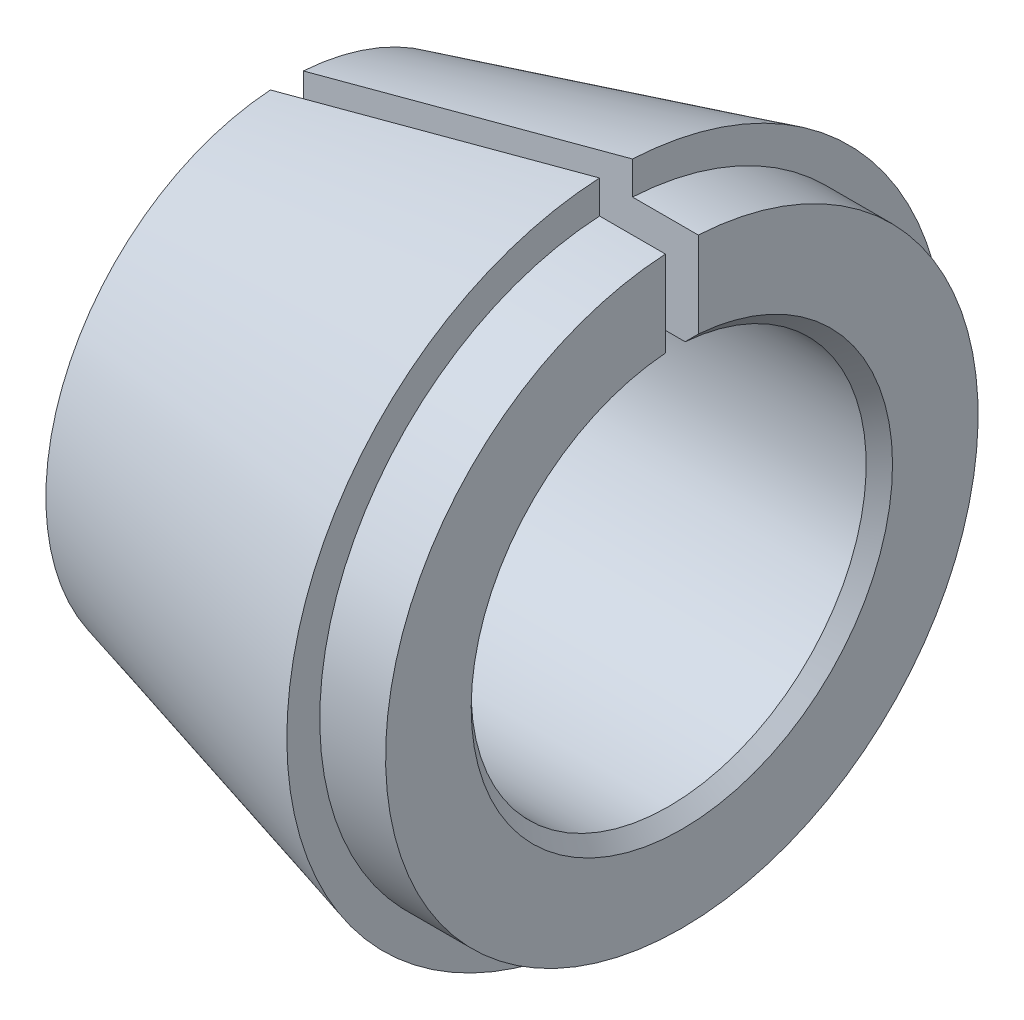
ISO-10303-21;
HEADER;
FILE_DESCRIPTION(('STEP AP214'),'2;1');
FILE_NAME('part.step','',(''),(''),'','','');
FILE_SCHEMA(('AUTOMOTIVE_DESIGN { 1 0 10303 214 1 1 1 1 }'));
ENDSEC;
DATA;
#1=APPLICATION_CONTEXT('core data for automotive mechanical design processes');
#2=APPLICATION_PROTOCOL_DEFINITION('international standard','automotive_design',2000,#1);
#3=PRODUCT_CONTEXT('',#1,'mechanical');
#4=PRODUCT('Part','Part','',(#3));
#5=PRODUCT_RELATED_PRODUCT_CATEGORY('part','',(#4));
#6=PRODUCT_DEFINITION_FORMATION('','',#4);
#7=PRODUCT_DEFINITION_CONTEXT('part definition',#1,'design');
#8=PRODUCT_DEFINITION('design','',#6,#7);
#9=PRODUCT_DEFINITION_SHAPE('','',#8);
#10=(LENGTH_UNIT() NAMED_UNIT(*) SI_UNIT(.MILLI.,.METRE.));
#11=(NAMED_UNIT(*) PLANE_ANGLE_UNIT() SI_UNIT($,.RADIAN.));
#12=(NAMED_UNIT(*) SI_UNIT($,.STERADIAN.) SOLID_ANGLE_UNIT());
#13=UNCERTAINTY_MEASURE_WITH_UNIT(LENGTH_MEASURE(1.E-05),#10,'distance_accuracy_value','');
#14=(GEOMETRIC_REPRESENTATION_CONTEXT(3) GLOBAL_UNCERTAINTY_ASSIGNED_CONTEXT((#13)) GLOBAL_UNIT_ASSIGNED_CONTEXT((#10,
#11,#12)) REPRESENTATION_CONTEXT('',''));
#15=CARTESIAN_POINT('',(0.,0.,0.));
#16=DIRECTION('',(0.,0.,1.));
#17=DIRECTION('',(1.,0.,0.));
#18=AXIS2_PLACEMENT_3D('',#15,#16,#17);
#19=CARTESIAN_POINT('',(-0.200000000000002,0.,0.));
#20=DIRECTION('',(1.,0.,0.));
#21=DIRECTION('',(0.,1.,0.));
#22=AXIS2_PLACEMENT_3D('',#19,#20,#21);
#23=CONICAL_SURFACE('',#22,3.,0.785398163397443);
#24=CARTESIAN_POINT('',(-0.200000000000002,0.,0.));
#25=DIRECTION('',(1.,0.,0.));
#26=DIRECTION('',(0.,1.,0.));
#27=AXIS2_PLACEMENT_3D('',#24,#25,#26);
#28=CIRCLE('',#27,3.);
#29=CARTESIAN_POINT('',(-0.200000000000002,2.98956518577535,0.25));
#30=VERTEX_POINT('',#29);
#31=CARTESIAN_POINT('',(-0.200000000000002,2.98956518577535,-0.25));
#32=VERTEX_POINT('',#31);
#33=EDGE_CURVE('E129',#30,#32,#28,.T.);
#34=ORIENTED_EDGE('',*,*,#33,.F.);
#35=CARTESIAN_POINT('',(-2.66711376518774,0.470603590352237,0.25));
#36=CARTESIAN_POINT('',(-2.6498790626406,0.490111763503367,0.25));
#37=CARTESIAN_POINT('',(-2.63252033393419,0.509509212474907,0.25));
#38=CARTESIAN_POINT('',(-2.59760937001322,0.548128017215426,0.25));
#39=CARTESIAN_POINT('',(-2.58005714213341,0.567349379608882,0.25));
#40=CARTESIAN_POINT('',(-2.52719359119103,0.624815712816943,0.25));
#41=CARTESIAN_POINT('',(-2.49167191801495,0.662866828880821,0.25));
#42=CARTESIAN_POINT('',(-2.42029667113215,0.738645739791032,0.25));
#43=CARTESIAN_POINT('',(-2.38444314177607,0.776373576580086,0.25));
#44=CARTESIAN_POINT('',(-2.31251318324246,0.851618364142729,0.25));
#45=CARTESIAN_POINT('',(-2.276436746691,0.889135307860569,0.25));
#46=CARTESIAN_POINT('',(-2.16801433047007,1.00143924613179,0.25));
#47=CARTESIAN_POINT('',(-2.09544539579988,1.07601076079007,0.25));
#48=CARTESIAN_POINT('',(-1.94999472058601,1.22484826261092,0.25));
#49=CARTESIAN_POINT('',(-1.87711297791828,1.29911424769215,0.25));
#50=CARTESIAN_POINT('',(-1.65819348190414,1.52164176661177,0.25));
#51=CARTESIAN_POINT('',(-1.51188121716294,1.66963311397587,0.25));
#52=CARTESIAN_POINT('',(-1.21892955487606,1.96532900190161,0.25));
#53=CARTESIAN_POINT('',(-1.07229011733684,2.11303350274599,0.25));
#54=CARTESIAN_POINT('',(-0.778841153523599,2.40827236116131,0.25));
#55=CARTESIAN_POINT('',(-0.632031627919382,2.55580671939774,0.25));
#56=CARTESIAN_POINT('',(-0.445148642724675,2.74348667298526,0.25));
#57=CARTESIAN_POINT('',(-0.405120873718359,2.78367780636682,0.25));
#58=CARTESIAN_POINT('',(-0.325059607630241,2.86405212469672,0.25));
#59=CARTESIAN_POINT('',(-0.285026110740466,2.9042353098363,0.25));
#60=CARTESIAN_POINT('',(0.162242787687722,3.35311658759649,0.25));
#61=CARTESIAN_POINT('',(0.569753263663969,3.76154055353879,0.25));
#62=CARTESIAN_POINT('',(1.18119474734201,4.3740698907972,0.25));
#63=CARTESIAN_POINT('',(1.38505512541592,4.57824583791917,0.25));
#64=CARTESIAN_POINT('',(1.79281205170518,4.98656151312424,0.25));
#65=CARTESIAN_POINT('',(1.99670859991173,5.19070124121613,0.25));
#66=CARTESIAN_POINT('',(2.200617813936,5.39482833574921,0.25));
#67=B_SPLINE_CURVE_WITH_KNOTS('',3,(#35,#36,#37,#38,#39,#40,#41,#42,#43,#44,#45,#46,#47,#48,#49,
#50,#51,#52,#53,#54,#55,#56,#57,#58,#59,#60,#61,#62,#63,#64,#65,#66),.UNSPECIFIED.,.F.,.F.,(4,2,
2,2,2,2,2,2,2,2,2,2,2,2,2,4),(0.,0.0780906859410044,0.156178421901177,0.312338211237489,
0.468477423707746,0.624621829326727,0.936780647884491,1.24894158944398,1.87326242618071,
2.4976642928112,3.12206370884976,3.29223405336983,3.46239962757663,5.19325872634942,
6.05883475381138,6.92441057103953),.UNSPECIFIED.);
#68=CARTESIAN_POINT('',(0.,3.19021942818985,0.25));
#69=VERTEX_POINT('',#68);
#70=EDGE_CURVE('E143',#30,#69,#67,.T.);
#71=ORIENTED_EDGE('',*,*,#70,.T.);
#72=CARTESIAN_POINT('',(0.,0.,0.));
#73=DIRECTION('',(1.,0.,0.));
#74=DIRECTION('',(0.,1.,0.));
#75=AXIS2_PLACEMENT_3D('',#72,#73,#74);
#76=CIRCLE('',#75,3.2);
#77=CARTESIAN_POINT('',(0.,3.19021942818985,-0.25));
#78=VERTEX_POINT('',#77);
#79=EDGE_CURVE('E136',#69,#78,#76,.T.);
#80=ORIENTED_EDGE('',*,*,#79,.T.);
#81=CARTESIAN_POINT('',(2.200617813936,5.39482833574921,-0.25));
#82=CARTESIAN_POINT('',(1.99672436377642,5.19071348795527,-0.25));
#83=CARTESIAN_POINT('',(1.79284091477196,4.98658864327339,-0.25));
#84=CARTESIAN_POINT('',(1.38511193765186,4.57830450006277,-0.25));
#85=CARTESIAN_POINT('',(1.18126640923297,4.37414520183689,-0.25));
#86=CARTESIAN_POINT('',(0.773632493464094,3.96577899891927,-0.25));
#87=CARTESIAN_POINT('',(0.569844104900843,3.76157209543868,-0.25));
#88=CARTESIAN_POINT('',(0.162349112625562,3.35307336957522,-0.25));
#89=CARTESIAN_POINT('',(-0.0413574904075303,3.14878154651493,-0.25));
#90=CARTESIAN_POINT('',(-0.346811001846159,2.84222808536969,-0.25));
#91=CARTESIAN_POINT('',(-0.448613531666726,2.74002187343519,-0.25));
#92=CARTESIAN_POINT('',(-0.652165872680217,2.53555761335125,-0.25));
#93=CARTESIAN_POINT('',(-0.753915684040837,2.43329956536878,-0.25));
#94=CARTESIAN_POINT('',(-0.957337653979458,2.22871129632099,-0.25));
#95=CARTESIAN_POINT('',(-1.05900981442538,2.12638107711347,-0.25));
#96=CARTESIAN_POINT('',(-1.26224071493553,1.92160573666105,-0.25));
#97=CARTESIAN_POINT('',(-1.36379945368776,1.81916061411393,-0.25));
#98=CARTESIAN_POINT('',(-1.5667422581918,1.61407995623535,-0.25));
#99=CARTESIAN_POINT('',(-1.66812630826193,1.51144440536825,-0.25));
#100=CARTESIAN_POINT('',(-1.81994976179631,1.35724622339316,-0.25));
#101=CARTESIAN_POINT('',(-1.8705144934332,1.30580702461644,-0.25));
#102=CARTESIAN_POINT('',(-1.97152492029961,1.20281059490399,-0.25));
#103=CARTESIAN_POINT('',(-2.02197061410325,1.15125336256882,-0.25));
#104=CARTESIAN_POINT('',(-2.12269307891911,1.04796055553384,-0.25));
#105=CARTESIAN_POINT('',(-2.17296982630304,0.996224957783616,-0.25));
#106=CARTESIAN_POINT('',(-2.27325061186618,0.892492749440925,-0.25));
#107=CARTESIAN_POINT('',(-2.32325465901946,0.840496147547108,-0.25));
#108=CARTESIAN_POINT('',(-2.3979177282966,0.762166178242518,-0.25));
#109=CARTESIAN_POINT('',(-2.4227501860155,0.735998277808991,-0.25));
#110=CARTESIAN_POINT('',(-2.47225485173967,0.683512143596488,-0.25));
#111=CARTESIAN_POINT('',(-2.49692706258947,0.657193912501678,-0.25));
#112=CARTESIAN_POINT('',(-2.54605613245007,0.604350620802389,-0.25));
#113=CARTESIAN_POINT('',(-2.57051296578879,0.577825536233749,-0.25));
#114=CARTESIAN_POINT('',(-2.61909310931655,0.52446909485813,-0.25));
#115=CARTESIAN_POINT('',(-2.64321639862149,0.497637719063725,-0.25));
#116=CARTESIAN_POINT('',(-2.66711376518774,0.470603590352237,-0.25));
#117=B_SPLINE_CURVE_WITH_KNOTS('',3,(#81,#82,#83,#84,#85,#86,#87,#88,#89,#90,#91,#92,#93,#94,
#95,#96,#97,#98,#99,#100,#101,#102,#103,#104,#105,#106,#107,#108,#109,#110,#111,#112,#113,#114,
#115,#116),.UNSPECIFIED.,.F.,.F.,(4,2,2,2,2,2,2,2,2,2,2,2,2,2,2,2,2,4),(0.,0.865516437340361,
1.73102562645916,2.59651478448795,3.46201098461514,3.89477971239988,4.32754705499977,
4.76030363688743,5.19306517388364,5.62586372262488,5.84225456595348,6.05864798829029,
6.27507051033134,6.49148586678579,6.59971052873333,6.70793326432321,6.81616872959577,
6.92441094137355),.UNSPECIFIED.);
#118=EDGE_CURVE('E46',#78,#32,#117,.T.);
#119=ORIENTED_EDGE('',*,*,#118,.T.);
#120=EDGE_LOOP('',(#34,#71,#80,#119));
#121=FACE_BOUND('',#120,.T.);
#122=ADVANCED_FACE('F31',(#121),#23,.F.);
#123=CARTESIAN_POINT('',(0.,0.,0.));
#124=DIRECTION('',(1.,0.,0.));
#125=DIRECTION('',(0.,1.,0.));
#126=AXIS2_PLACEMENT_3D('',#123,#124,#125);
#127=CYLINDRICAL_SURFACE('',#126,3.);
#128=CARTESIAN_POINT('',(-5.8,0.,0.));
#129=DIRECTION('',(1.,0.,0.));
#130=DIRECTION('',(0.,1.,0.));
#131=AXIS2_PLACEMENT_3D('',#128,#129,#130);
#132=CIRCLE('',#131,3.);
#133=CARTESIAN_POINT('',(-5.8,2.98956518577535,0.25));
#134=VERTEX_POINT('',#133);
#135=CARTESIAN_POINT('',(-5.8,2.98956518577535,-0.25));
#136=VERTEX_POINT('',#135);
#137=EDGE_CURVE('E121',#134,#136,#132,.T.);
#138=ORIENTED_EDGE('',*,*,#137,.F.);
#139=DIRECTION('',(1.,0.,0.));
#140=VECTOR('',#139,1.);
#141=CARTESIAN_POINT('',(0.,2.98956518577535,0.25));
#142=LINE('',#141,#140);
#143=EDGE_CURVE('E146',#134,#30,#142,.T.);
#144=ORIENTED_EDGE('',*,*,#143,.T.);
#145=ORIENTED_EDGE('',*,*,#33,.T.);
#146=DIRECTION('',(1.,0.,0.));
#147=VECTOR('',#146,1.);
#148=CARTESIAN_POINT('',(0.,2.98956518577535,-0.25));
#149=LINE('',#148,#147);
#150=EDGE_CURVE('E191',#32,#136,#149,.F.);
#151=ORIENTED_EDGE('',*,*,#150,.T.);
#152=EDGE_LOOP('',(#138,#144,#145,#151));
#153=FACE_BOUND('',#152,.T.);
#154=ADVANCED_FACE('F206',(#153),#127,.F.);
#155=CARTESIAN_POINT('',(-6.,0.,0.));
#156=DIRECTION('',(-1.,0.,0.));
#157=DIRECTION('',(0.,-1.,0.));
#158=AXIS2_PLACEMENT_3D('',#155,#156,#157);
#159=CONICAL_SURFACE('',#158,3.2,0.785398163397443);
#160=CARTESIAN_POINT('',(-6.,0.,0.));
#161=DIRECTION('',(1.,0.,0.));
#162=DIRECTION('',(0.,1.,0.));
#163=AXIS2_PLACEMENT_3D('',#160,#161,#162);
#164=CIRCLE('',#163,3.2);
#165=CARTESIAN_POINT('',(-6.,3.19021942818985,0.25));
#166=VERTEX_POINT('',#165);
#167=CARTESIAN_POINT('',(-6.,3.19021942818985,-0.25));
#168=VERTEX_POINT('',#167);
#169=EDGE_CURVE('E113',#166,#168,#164,.T.);
#170=ORIENTED_EDGE('',*,*,#169,.F.);
#171=CARTESIAN_POINT('',(-8.200617813936,5.39482833574921,0.25));
#172=CARTESIAN_POINT('',(-7.99672436377643,5.19071348795527,0.25));
#173=CARTESIAN_POINT('',(-7.79284091477196,4.98658864327339,0.25));
#174=CARTESIAN_POINT('',(-7.38511193765187,4.57830450006277,0.25));
#175=CARTESIAN_POINT('',(-7.18126640923297,4.37414520183689,0.25));
#176=CARTESIAN_POINT('',(-6.7736324934641,3.96577899891927,0.25));
#177=CARTESIAN_POINT('',(-6.56984410490084,3.76157209543868,0.25));
#178=CARTESIAN_POINT('',(-6.16234911262556,3.35307336957522,0.25));
#179=CARTESIAN_POINT('',(-5.95864250959247,3.14878154651493,0.25));
#180=CARTESIAN_POINT('',(-5.65318899815384,2.84222808536969,0.25));
#181=CARTESIAN_POINT('',(-5.55138646833327,2.74002187343519,0.25));
#182=CARTESIAN_POINT('',(-5.34783412731978,2.53555761335125,0.25));
#183=CARTESIAN_POINT('',(-5.24608431595916,2.43329956536878,0.25));
#184=CARTESIAN_POINT('',(-5.04266234602054,2.22871129632099,0.25));
#185=CARTESIAN_POINT('',(-4.94099018557462,2.12638107711347,0.25));
#186=CARTESIAN_POINT('',(-4.73775928506446,1.92160573666105,0.25));
#187=CARTESIAN_POINT('',(-4.63620054631224,1.81916061411393,0.25));
#188=CARTESIAN_POINT('',(-4.4332577418082,1.61407995623535,0.25));
#189=CARTESIAN_POINT('',(-4.33187369173806,1.51144440536825,0.25));
#190=CARTESIAN_POINT('',(-4.18005023820368,1.35724622339316,0.25));
#191=CARTESIAN_POINT('',(-4.1294855065668,1.30580702461644,0.25));
#192=CARTESIAN_POINT('',(-4.02847507970038,1.20281059490399,0.25));
#193=CARTESIAN_POINT('',(-3.97802938589675,1.15125336256882,0.25));
#194=CARTESIAN_POINT('',(-3.87730692108089,1.04796055553384,0.25));
#195=CARTESIAN_POINT('',(-3.82703017369696,0.996224957783616,0.25));
#196=CARTESIAN_POINT('',(-3.72674938813382,0.892492749440924,0.25));
#197=CARTESIAN_POINT('',(-3.67674534098054,0.840496147547108,0.25));
#198=CARTESIAN_POINT('',(-3.6020822717034,0.762166178242518,0.25));
#199=CARTESIAN_POINT('',(-3.5772498139845,0.735998277808991,0.25));
#200=CARTESIAN_POINT('',(-3.52774514826032,0.683512143596488,0.25));
#201=CARTESIAN_POINT('',(-3.50307293741053,0.657193912501678,0.25));
#202=CARTESIAN_POINT('',(-3.45394386754993,0.604350620802389,0.25));
#203=CARTESIAN_POINT('',(-3.42948703421121,0.577825536233749,0.25));
#204=CARTESIAN_POINT('',(-3.38090689068345,0.52446909485813,0.25));
#205=CARTESIAN_POINT('',(-3.35678360137851,0.497637719063724,0.25));
#206=CARTESIAN_POINT('',(-3.33288623481226,0.470603590352237,0.25));
#207=B_SPLINE_CURVE_WITH_KNOTS('',3,(#171,#172,#173,#174,#175,#176,#177,#178,#179,#180,#181,
#182,#183,#184,#185,#186,#187,#188,#189,#190,#191,#192,#193,#194,#195,#196,#197,#198,#199,#200,
#201,#202,#203,#204,#205,#206),.UNSPECIFIED.,.F.,.F.,(4,2,2,2,2,2,2,2,2,2,2,2,2,2,2,2,2,4),(0.,
0.865516437340361,1.73102562645916,2.59651478448795,3.46201098461514,3.89477971239988,
4.32754705499977,4.76030363688743,5.19306517388364,5.62586372262488,5.84225456595348,
6.05864798829029,6.27507051033134,6.49148586678579,6.59971052873334,6.70793326432321,
6.81616872959577,6.92441094137355),.UNSPECIFIED.);
#208=EDGE_CURVE('E198',#166,#134,#207,.T.);
#209=ORIENTED_EDGE('',*,*,#208,.T.);
#210=ORIENTED_EDGE('',*,*,#137,.T.);
#211=CARTESIAN_POINT('',(-3.33288623481226,0.470603590352237,-0.25));
#212=CARTESIAN_POINT('',(-3.3501209373594,0.490111763503367,-0.25));
#213=CARTESIAN_POINT('',(-3.36747966606581,0.509509212474907,-0.25));
#214=CARTESIAN_POINT('',(-3.40239062998678,0.548128017215425,-0.25));
#215=CARTESIAN_POINT('',(-3.41994285786659,0.567349379608881,-0.25));
#216=CARTESIAN_POINT('',(-3.47280640880897,0.624815712816942,-0.25));
#217=CARTESIAN_POINT('',(-3.50832808198505,0.66286682888082,-0.25));
#218=CARTESIAN_POINT('',(-3.57970332886785,0.738645739791031,-0.25));
#219=CARTESIAN_POINT('',(-3.61555685822393,0.776373576580086,-0.25));
#220=CARTESIAN_POINT('',(-3.68748681675754,0.851618364142729,-0.25));
#221=CARTESIAN_POINT('',(-3.723563253309,0.889135307860569,-0.25));
#222=CARTESIAN_POINT('',(-3.83198566952993,1.00143924613179,-0.25));
#223=CARTESIAN_POINT('',(-3.90455460420012,1.07601076079007,-0.25));
#224=CARTESIAN_POINT('',(-4.05000527941399,1.22484826261092,-0.25));
#225=CARTESIAN_POINT('',(-4.12288702208171,1.29911424769214,-0.25));
#226=CARTESIAN_POINT('',(-4.34180651809586,1.52164176661177,-0.25));
#227=CARTESIAN_POINT('',(-4.48811878283706,1.66963311397587,-0.25));
#228=CARTESIAN_POINT('',(-4.78107044512393,1.96532900190161,-0.25));
#229=CARTESIAN_POINT('',(-4.92770988266316,2.11303350274598,-0.25));
#230=CARTESIAN_POINT('',(-5.2211588464764,2.40827236116131,-0.25));
#231=CARTESIAN_POINT('',(-5.36796837208062,2.55580671939774,-0.25));
#232=CARTESIAN_POINT('',(-5.55485135727532,2.74348667298526,-0.25));
#233=CARTESIAN_POINT('',(-5.59487912628164,2.78367780636681,-0.25));
#234=CARTESIAN_POINT('',(-5.67494039236976,2.86405212469672,-0.25));
#235=CARTESIAN_POINT('',(-5.71497388925953,2.9042353098363,-0.25));
#236=CARTESIAN_POINT('',(-6.16224278768772,3.35311658759649,-0.25));
#237=CARTESIAN_POINT('',(-6.56975326366397,3.76154055353879,-0.25));
#238=CARTESIAN_POINT('',(-7.18119474734201,4.3740698907972,-0.25));
#239=CARTESIAN_POINT('',(-7.38505512541593,4.57824583791917,-0.25));
#240=CARTESIAN_POINT('',(-7.79281205170518,4.98656151312424,-0.25));
#241=CARTESIAN_POINT('',(-7.99670859991173,5.19070124121613,-0.25));
#242=CARTESIAN_POINT('',(-8.200617813936,5.39482833574921,-0.25));
#243=B_SPLINE_CURVE_WITH_KNOTS('',3,(#211,#212,#213,#214,#215,#216,#217,#218,#219,#220,#221,
#222,#223,#224,#225,#226,#227,#228,#229,#230,#231,#232,#233,#234,#235,#236,#237,#238,#239,#240,
#241,#242),.UNSPECIFIED.,.F.,.F.,(4,2,2,2,2,2,2,2,2,2,2,2,2,2,2,4),(0.,0.0780906859410044,
0.156178421901177,0.312338211237489,0.468477423707746,0.624621829326727,0.936780647884491,
1.24894158944398,1.87326242618071,2.4976642928112,3.12206370884976,3.29223405336983,
3.46239962757663,5.19325872634942,6.05883475381139,6.92441057103953),.UNSPECIFIED.);
#244=EDGE_CURVE('E104',#136,#168,#243,.T.);
#245=ORIENTED_EDGE('',*,*,#244,.T.);
#246=EDGE_LOOP('',(#170,#209,#210,#245));
#247=FACE_BOUND('',#246,.T.);
#248=ADVANCED_FACE('F203',(#247),#159,.F.);
#249=CARTESIAN_POINT('',(-6.,3.2,0.));
#250=DIRECTION('',(-1.,0.,0.));
#251=DIRECTION('',(0.,-1.,0.));
#252=AXIS2_PLACEMENT_3D('',#249,#250,#251);
#253=PLANE('',#252);
#254=CARTESIAN_POINT('',(-6.,0.,0.));
#255=DIRECTION('',(1.,0.,0.));
#256=DIRECTION('',(0.,1.,0.));
#257=AXIS2_PLACEMENT_3D('',#254,#255,#256);
#258=CIRCLE('',#257,3.66025403784438);
#259=CARTESIAN_POINT('',(-6.,3.65170639859725,0.25));
#260=VERTEX_POINT('',#259);
#261=CARTESIAN_POINT('',(-6.,3.65170639859725,-0.25));
#262=VERTEX_POINT('',#261);
#263=EDGE_CURVE('E111',#260,#262,#258,.T.);
#264=ORIENTED_EDGE('',*,*,#263,.F.);
#265=DIRECTION('',(0.,-1.,0.));
#266=VECTOR('',#265,1.);
#267=CARTESIAN_POINT('',(-6.,5.,0.25));
#268=LINE('',#267,#266);
#269=EDGE_CURVE('E114',#260,#166,#268,.T.);
#270=ORIENTED_EDGE('',*,*,#269,.T.);
#271=ORIENTED_EDGE('',*,*,#169,.T.);
#272=DIRECTION('',(0.,-1.,0.));
#273=VECTOR('',#272,1.);
#274=CARTESIAN_POINT('',(-6.,5.,-0.25));
#275=LINE('',#274,#273);
#276=EDGE_CURVE('E96',#262,#168,#275,.T.);
#277=ORIENTED_EDGE('',*,*,#276,.F.);
#278=EDGE_LOOP('',(#264,#270,#271,#277));
#279=FACE_BOUND('',#278,.T.);
#280=ADVANCED_FACE('F109',(#279),#253,.T.);
#281=CARTESIAN_POINT('',(-0.999999999999999,0.,0.));
#282=DIRECTION('',(1.,0.,0.));
#283=DIRECTION('',(0.,1.,0.));
#284=AXIS2_PLACEMENT_3D('',#281,#282,#283);
#285=CONICAL_SURFACE('',#284,5.,0.26179938779915);
#286=CARTESIAN_POINT('',(-0.999999999999999,0.,0.));
#287=DIRECTION('',(1.,0.,0.));
#288=DIRECTION('',(0.,1.,0.));
#289=AXIS2_PLACEMENT_3D('',#286,#287,#288);
#290=CIRCLE('',#289,5.);
#291=CARTESIAN_POINT('',(-1.,4.99374608885955,0.25));
#292=VERTEX_POINT('',#291);
#293=CARTESIAN_POINT('',(-1.,4.99374608885955,-0.25));
#294=VERTEX_POINT('',#293);
#295=EDGE_CURVE('E119',#292,#294,#290,.T.);
#296=ORIENTED_EDGE('',*,*,#295,.F.);
#297=CARTESIAN_POINT('',(-11.3502990569881,2.21256665216427,0.25));
#298=CARTESIAN_POINT('',(-10.7810166461619,2.36606059343027,0.25));
#299=CARTESIAN_POINT('',(-10.2116920499147,2.51939790256179,0.25));
#300=CARTESIAN_POINT('',(-9.07298376936265,2.82585285711416,0.25));
#301=CARTESIAN_POINT('',(-8.50360008506114,2.97897050254775,0.25));
#302=CARTESIAN_POINT('',(-7.13920309253241,3.34571978179236,0.25));
#303=CARTESIAN_POINT('',(-6.344173706091,3.55929158371591,0.25));
#304=CARTESIAN_POINT('',(-4.58216277585076,4.03245700848804,0.25));
#305=CARTESIAN_POINT('',(-3.61517200690415,4.29201627501212,0.25));
#306=CARTESIAN_POINT('',(-1.68115789887087,4.81101343814341,0.25));
#307=CARTESIAN_POINT('',(-0.714134559784067,5.07045133475014,0.25));
#308=CARTESIAN_POINT('',(2.30178954070026,5.8794580319696,0.25));
#309=CARTESIAN_POINT('',(4.3507240690917,6.42890094371734,0.25));
#310=CARTESIAN_POINT('',(8.44863712316694,7.52762242297165,0.25));
#311=CARTESIAN_POINT('',(10.4976156488494,8.07690099048334,0.25));
#312=CARTESIAN_POINT('',(12.5465947907965,8.62617720081395,0.25));
#313=B_SPLINE_CURVE_WITH_KNOTS('',3,(#297,#298,#299,#300,#301,#302,#303,#304,#305,#306,#307,
#308,#309,#310,#311,#312),.UNSPECIFIED.,.F.,.F.,(4,2,2,2,2,2,2,4),(0.,1.76883729445324,
3.53767448632221,6.0073225722555,9.01098356344469,12.0146445664717,18.3786198787765,
24.7425949924972),.UNSPECIFIED.);
#314=EDGE_CURVE('E118',#292,#260,#313,.F.);
#315=ORIENTED_EDGE('',*,*,#314,.T.);
#316=ORIENTED_EDGE('',*,*,#263,.T.);
#317=CARTESIAN_POINT('',(-11.3502990569881,2.21256665216427,-0.25));
#318=CARTESIAN_POINT('',(-10.7810166461619,2.36606059343027,-0.25));
#319=CARTESIAN_POINT('',(-10.2116920499147,2.51939790256179,-0.25));
#320=CARTESIAN_POINT('',(-9.07298376936265,2.82585285711416,-0.25));
#321=CARTESIAN_POINT('',(-8.50360008506114,2.97897050254775,-0.25));
#322=CARTESIAN_POINT('',(-7.13920309253241,3.34571978179236,-0.25));
#323=CARTESIAN_POINT('',(-6.344173706091,3.55929158371591,-0.25));
#324=CARTESIAN_POINT('',(-4.58216277585076,4.03245700848804,-0.25));
#325=CARTESIAN_POINT('',(-3.61517200690415,4.29201627501212,-0.25));
#326=CARTESIAN_POINT('',(-1.68115789887087,4.81101343814341,-0.25));
#327=CARTESIAN_POINT('',(-0.714134559784067,5.07045133475014,-0.25));
#328=CARTESIAN_POINT('',(2.30178954070026,5.8794580319696,-0.25));
#329=CARTESIAN_POINT('',(4.3507240690917,6.42890094371734,-0.25));
#330=CARTESIAN_POINT('',(8.44863712316694,7.52762242297165,-0.25));
#331=CARTESIAN_POINT('',(10.4976156488494,8.07690099048334,-0.25));
#332=CARTESIAN_POINT('',(12.5465947907965,8.62617720081395,-0.25));
#333=B_SPLINE_CURVE_WITH_KNOTS('',3,(#317,#318,#319,#320,#321,#322,#323,#324,#325,#326,#327,
#328,#329,#330,#331,#332),.UNSPECIFIED.,.F.,.F.,(4,2,2,2,2,2,2,4),(0.,1.76883729445324,
3.53767448632221,6.0073225722555,9.01098356344469,12.0146445664717,18.3786198787765,
24.7425949924972),.UNSPECIFIED.);
#334=EDGE_CURVE('E93',#262,#294,#333,.T.);
#335=ORIENTED_EDGE('',*,*,#334,.T.);
#336=EDGE_LOOP('',(#296,#315,#316,#335));
#337=FACE_BOUND('',#336,.T.);
#338=ADVANCED_FACE('F117',(#337),#285,.T.);
#339=CARTESIAN_POINT('',(-1.,5.,0.));
#340=DIRECTION('',(1.,0.,0.));
#341=DIRECTION('',(0.,1.,0.));
#342=AXIS2_PLACEMENT_3D('',#339,#340,#341);
#343=PLANE('',#342);
#344=CARTESIAN_POINT('',(-0.999999999999999,0.,0.));
#345=DIRECTION('',(1.,0.,0.));
#346=DIRECTION('',(0.,1.,0.));
#347=AXIS2_PLACEMENT_3D('',#344,#345,#346);
#348=CIRCLE('',#347,4.5);
#349=CARTESIAN_POINT('',(-1.,4.49305018890286,0.25));
#350=VERTEX_POINT('',#349);
#351=CARTESIAN_POINT('',(-1.,4.49305018890286,-0.25));
#352=VERTEX_POINT('',#351);
#353=EDGE_CURVE('E123',#350,#352,#348,.T.);
#354=ORIENTED_EDGE('',*,*,#353,.F.);
#355=DIRECTION('',(0.,1.,0.));
#356=VECTOR('',#355,1.);
#357=CARTESIAN_POINT('',(-1.,5.,0.25));
#358=LINE('',#357,#356);
#359=EDGE_CURVE('E161',#350,#292,#358,.T.);
#360=ORIENTED_EDGE('',*,*,#359,.T.);
#361=ORIENTED_EDGE('',*,*,#295,.T.);
#362=DIRECTION('',(0.,-1.,0.));
#363=VECTOR('',#362,1.);
#364=CARTESIAN_POINT('',(-1.,5.,-0.25));
#365=LINE('',#364,#363);
#366=EDGE_CURVE('E99',#294,#352,#365,.T.);
#367=ORIENTED_EDGE('',*,*,#366,.T.);
#368=EDGE_LOOP('',(#354,#360,#361,#367));
#369=FACE_BOUND('',#368,.T.);
#370=ADVANCED_FACE('F160',(#369),#343,.T.);
#371=CARTESIAN_POINT('',(0.,0.,0.));
#372=DIRECTION('',(1.,0.,0.));
#373=DIRECTION('',(0.,1.,0.));
#374=AXIS2_PLACEMENT_3D('',#371,#372,#373);
#375=CYLINDRICAL_SURFACE('',#374,4.5);
#376=CARTESIAN_POINT('',(0.,0.,0.));
#377=DIRECTION('',(1.,0.,0.));
#378=DIRECTION('',(0.,1.,0.));
#379=AXIS2_PLACEMENT_3D('',#376,#377,#378);
#380=CIRCLE('',#379,4.5);
#381=CARTESIAN_POINT('',(0.,4.49305018890286,0.25));
#382=VERTEX_POINT('',#381);
#383=CARTESIAN_POINT('',(0.,4.49305018890286,-0.25));
#384=VERTEX_POINT('',#383);
#385=EDGE_CURVE('E138',#382,#384,#380,.T.);
#386=ORIENTED_EDGE('',*,*,#385,.F.);
#387=DIRECTION('',(1.,0.,0.));
#388=VECTOR('',#387,1.);
#389=CARTESIAN_POINT('',(0.,4.49305018890286,0.25));
#390=LINE('',#389,#388);
#391=EDGE_CURVE('E54',#382,#350,#390,.F.);
#392=ORIENTED_EDGE('',*,*,#391,.T.);
#393=ORIENTED_EDGE('',*,*,#353,.T.);
#394=DIRECTION('',(1.,0.,0.));
#395=VECTOR('',#394,1.);
#396=CARTESIAN_POINT('',(0.,4.49305018890286,-0.25));
#397=LINE('',#396,#395);
#398=EDGE_CURVE('E157',#352,#384,#397,.T.);
#399=ORIENTED_EDGE('',*,*,#398,.T.);
#400=EDGE_LOOP('',(#386,#392,#393,#399));
#401=FACE_BOUND('',#400,.T.);
#402=ADVANCED_FACE('F156',(#401),#375,.T.);
#403=CARTESIAN_POINT('',(0.,3.2,0.));
#404=DIRECTION('',(1.,0.,0.));
#405=DIRECTION('',(0.,1.,0.));
#406=AXIS2_PLACEMENT_3D('',#403,#404,#405);
#407=PLANE('',#406);
#408=ORIENTED_EDGE('',*,*,#79,.F.);
#409=DIRECTION('',(0.,1.,0.));
#410=VECTOR('',#409,1.);
#411=CARTESIAN_POINT('',(0.,3.2,0.25));
#412=LINE('',#411,#410);
#413=EDGE_CURVE('E11',#69,#382,#412,.T.);
#414=ORIENTED_EDGE('',*,*,#413,.T.);
#415=ORIENTED_EDGE('',*,*,#385,.T.);
#416=DIRECTION('',(0.,-1.,0.));
#417=VECTOR('',#416,1.);
#418=CARTESIAN_POINT('',(0.,3.2,-0.25));
#419=LINE('',#418,#417);
#420=EDGE_CURVE('E39',#384,#78,#419,.T.);
#421=ORIENTED_EDGE('',*,*,#420,.T.);
#422=EDGE_LOOP('',(#408,#414,#415,#421));
#423=FACE_BOUND('',#422,.T.);
#424=ADVANCED_FACE('F135',(#423),#407,.T.);
#425=CARTESIAN_POINT('',(-6.,5.,-0.25));
#426=DIRECTION('',(0.,0.,1.));
#427=DIRECTION('',(1.,0.,0.));
#428=AXIS2_PLACEMENT_3D('',#425,#426,#427);
#429=PLANE('',#428);
#430=ORIENTED_EDGE('',*,*,#420,.F.);
#431=ORIENTED_EDGE('',*,*,#398,.F.);
#432=ORIENTED_EDGE('',*,*,#366,.F.);
#433=ORIENTED_EDGE('',*,*,#334,.F.);
#434=ORIENTED_EDGE('',*,*,#276,.T.);
#435=ORIENTED_EDGE('',*,*,#244,.F.);
#436=ORIENTED_EDGE('',*,*,#150,.F.);
#437=ORIENTED_EDGE('',*,*,#118,.F.);
#438=EDGE_LOOP('',(#430,#431,#432,#433,#434,#435,#436,#437));
#439=FACE_BOUND('',#438,.T.);
#440=ADVANCED_FACE('F95',(#439),#429,.T.);
#441=CARTESIAN_POINT('',(-6.,5.,0.25));
#442=DIRECTION('',(0.,0.,-1.));
#443=DIRECTION('',(-1.,0.,0.));
#444=AXIS2_PLACEMENT_3D('',#441,#442,#443);
#445=PLANE('',#444);
#446=ORIENTED_EDGE('',*,*,#143,.F.);
#447=ORIENTED_EDGE('',*,*,#208,.F.);
#448=ORIENTED_EDGE('',*,*,#269,.F.);
#449=ORIENTED_EDGE('',*,*,#314,.F.);
#450=ORIENTED_EDGE('',*,*,#359,.F.);
#451=ORIENTED_EDGE('',*,*,#391,.F.);
#452=ORIENTED_EDGE('',*,*,#413,.F.);
#453=ORIENTED_EDGE('',*,*,#70,.F.);
#454=EDGE_LOOP('',(#446,#447,#448,#449,#450,#451,#452,#453));
#455=FACE_BOUND('',#454,.T.);
#456=ADVANCED_FACE('F181',(#455),#445,.T.);
#457=CLOSED_SHELL('',(#122,#154,#248,#280,#338,#370,#402,#424,#440,#456));
#458=MANIFOLD_SOLID_BREP('B2',#457);
#459=ADVANCED_BREP_SHAPE_REPRESENTATION('',(#18,#458),#14);
#460=SHAPE_DEFINITION_REPRESENTATION(#9,#459);
ENDSEC;
END-ISO-10303-21;
